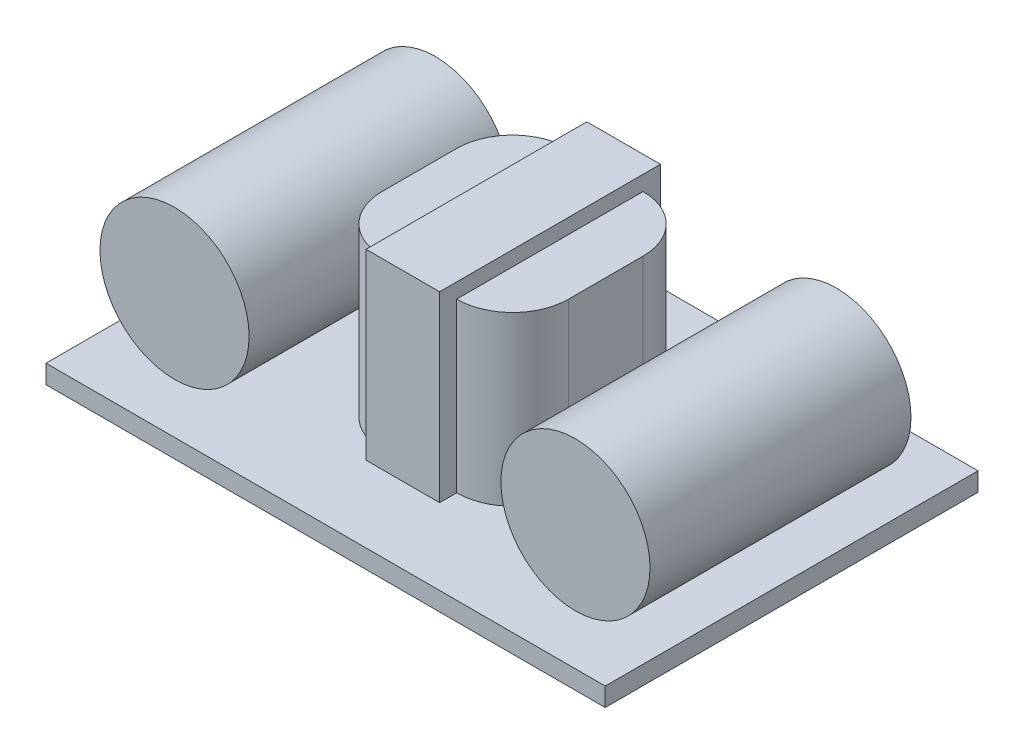
ISO-10303-21;
HEADER;
FILE_DESCRIPTION(('STEP AP214'),'2;1');
FILE_NAME('part.step','',(''),(''),'','','');
FILE_SCHEMA(('AUTOMOTIVE_DESIGN { 1 0 10303 214 1 1 1 1 }'));
ENDSEC;
DATA;
#1=APPLICATION_CONTEXT('core data for automotive mechanical design processes');
#2=APPLICATION_PROTOCOL_DEFINITION('international standard','automotive_design',2000,#1);
#3=PRODUCT_CONTEXT('',#1,'mechanical');
#4=PRODUCT('Part','Part','',(#3));
#5=PRODUCT_RELATED_PRODUCT_CATEGORY('part','',(#4));
#6=PRODUCT_DEFINITION_FORMATION('','',#4);
#7=PRODUCT_DEFINITION_CONTEXT('part definition',#1,'design');
#8=PRODUCT_DEFINITION('design','',#6,#7);
#9=PRODUCT_DEFINITION_SHAPE('','',#8);
#10=(LENGTH_UNIT() NAMED_UNIT(*) SI_UNIT(.MILLI.,.METRE.));
#11=(NAMED_UNIT(*) PLANE_ANGLE_UNIT() SI_UNIT($,.RADIAN.));
#12=(NAMED_UNIT(*) SI_UNIT($,.STERADIAN.) SOLID_ANGLE_UNIT());
#13=UNCERTAINTY_MEASURE_WITH_UNIT(LENGTH_MEASURE(1.E-05),#10,'distance_accuracy_value','');
#14=(GEOMETRIC_REPRESENTATION_CONTEXT(3) GLOBAL_UNCERTAINTY_ASSIGNED_CONTEXT((#13)) GLOBAL_UNIT_ASSIGNED_CONTEXT((#10,
#11,#12)) REPRESENTATION_CONTEXT('',''));
#15=CARTESIAN_POINT('',(0.,0.,0.));
#16=DIRECTION('',(0.,0.,1.));
#17=DIRECTION('',(1.,0.,0.));
#18=AXIS2_PLACEMENT_3D('',#15,#16,#17);
#19=CARTESIAN_POINT('',(12.7389872475368,5.12016710144614,7.));
#20=DIRECTION('',(0.,0.,-1.));
#21=DIRECTION('',(-1.,0.,0.));
#22=AXIS2_PLACEMENT_3D('',#19,#20,#21);
#23=CYLINDRICAL_SURFACE('',#22,4.);
#24=CARTESIAN_POINT('',(12.7389872475368,5.12016710144614,7.));
#25=DIRECTION('',(0.,0.,1.));
#26=DIRECTION('',(1.,0.,0.));
#27=AXIS2_PLACEMENT_3D('',#24,#25,#26);
#28=CIRCLE('',#27,4.);
#29=CARTESIAN_POINT('',(16.7389872475368,5.12016710144614,7.));
#30=VERTEX_POINT('',#29);
#31=EDGE_CURVE('E11',#30,#30,#28,.T.);
#32=ORIENTED_EDGE('',*,*,#31,.F.);
#33=EDGE_LOOP('',(#32));
#34=FACE_BOUND('',#33,.T.);
#35=CARTESIAN_POINT('',(12.7389872475368,5.12016710144614,-7.));
#36=DIRECTION('',(0.,0.,1.));
#37=DIRECTION('',(1.,0.,0.));
#38=AXIS2_PLACEMENT_3D('',#35,#36,#37);
#39=CIRCLE('',#38,4.);
#40=CARTESIAN_POINT('',(16.7389872475368,5.12016710144614,-7.));
#41=VERTEX_POINT('',#40);
#42=EDGE_CURVE('E44',#41,#41,#39,.T.);
#43=ORIENTED_EDGE('',*,*,#42,.T.);
#44=EDGE_LOOP('',(#43));
#45=FACE_BOUND('',#44,.T.);
#46=ADVANCED_FACE('F41',(#34,#45),#23,.T.);
#47=CARTESIAN_POINT('',(12.7389872475368,5.12016710144614,7.));
#48=DIRECTION('',(0.,0.,1.));
#49=DIRECTION('',(1.,0.,0.));
#50=AXIS2_PLACEMENT_3D('',#47,#48,#49);
#51=PLANE('',#50);
#52=ORIENTED_EDGE('',*,*,#31,.T.);
#53=EDGE_LOOP('',(#52));
#54=FACE_BOUND('',#53,.T.);
#55=ADVANCED_FACE('F56',(#54),#51,.T.);
#56=CARTESIAN_POINT('',(12.7389872475368,5.12016710144614,-7.));
#57=DIRECTION('',(0.,0.,1.));
#58=DIRECTION('',(1.,0.,0.));
#59=AXIS2_PLACEMENT_3D('',#56,#57,#58);
#60=PLANE('',#59);
#61=ORIENTED_EDGE('',*,*,#42,.F.);
#62=EDGE_LOOP('',(#61));
#63=FACE_BOUND('',#62,.T.);
#64=ADVANCED_FACE('F54',(#63),#60,.F.);
#65=CLOSED_SHELL('',(#46,#55,#64));
#66=MANIFOLD_SOLID_BREP('B2',#65);
#67=CARTESIAN_POINT('',(-8.77028567959707,5.12016710144614,7.));
#68=DIRECTION('',(0.,0.,-1.));
#69=DIRECTION('',(-1.,0.,0.));
#70=AXIS2_PLACEMENT_3D('',#67,#68,#69);
#71=CYLINDRICAL_SURFACE('',#70,4.);
#72=CARTESIAN_POINT('',(-8.77028567959707,5.12016710144614,7.));
#73=DIRECTION('',(0.,0.,1.));
#74=DIRECTION('',(1.,0.,0.));
#75=AXIS2_PLACEMENT_3D('',#72,#73,#74);
#76=CIRCLE('',#75,4.);
#77=CARTESIAN_POINT('',(-4.77028567959707,5.12016710144614,7.));
#78=VERTEX_POINT('',#77);
#79=EDGE_CURVE('E40',#78,#78,#76,.T.);
#80=ORIENTED_EDGE('',*,*,#79,.F.);
#81=EDGE_LOOP('',(#80));
#82=FACE_BOUND('',#81,.T.);
#83=CARTESIAN_POINT('',(-8.77028567959707,5.12016710144614,-7.));
#84=DIRECTION('',(0.,0.,1.));
#85=DIRECTION('',(1.,0.,0.));
#86=AXIS2_PLACEMENT_3D('',#83,#84,#85);
#87=CIRCLE('',#86,4.);
#88=CARTESIAN_POINT('',(-4.77028567959707,5.12016710144614,-7.));
#89=VERTEX_POINT('',#88);
#90=EDGE_CURVE('E100',#89,#89,#87,.T.);
#91=ORIENTED_EDGE('',*,*,#90,.T.);
#92=EDGE_LOOP('',(#91));
#93=FACE_BOUND('',#92,.T.);
#94=ADVANCED_FACE('F97',(#82,#93),#71,.T.);
#95=CARTESIAN_POINT('',(-8.77028567959707,5.12016710144614,7.));
#96=DIRECTION('',(0.,0.,1.));
#97=DIRECTION('',(1.,0.,0.));
#98=AXIS2_PLACEMENT_3D('',#95,#96,#97);
#99=PLANE('',#98);
#100=ORIENTED_EDGE('',*,*,#79,.T.);
#101=EDGE_LOOP('',(#100));
#102=FACE_BOUND('',#101,.T.);
#103=ADVANCED_FACE('F112',(#102),#99,.T.);
#104=CARTESIAN_POINT('',(-8.77028567959707,5.12016710144614,-7.));
#105=DIRECTION('',(0.,0.,1.));
#106=DIRECTION('',(1.,0.,0.));
#107=AXIS2_PLACEMENT_3D('',#104,#105,#106);
#108=PLANE('',#107);
#109=ORIENTED_EDGE('',*,*,#90,.F.);
#110=EDGE_LOOP('',(#109));
#111=FACE_BOUND('',#110,.T.);
#112=ADVANCED_FACE('F110',(#111),#108,.F.);
#113=CLOSED_SHELL('',(#94,#103,#112));
#114=MANIFOLD_SOLID_BREP('B6',#113);
#115=CARTESIAN_POINT('',(0.,10.,0.));
#116=DIRECTION('',(0.,1.,0.));
#117=DIRECTION('',(0.,0.,1.));
#118=AXIS2_PLACEMENT_3D('',#115,#116,#117);
#119=PLANE('',#118);
#120=CARTESIAN_POINT('',(3.94697795764397,10.,-2.41888949530825));
#121=DIRECTION('',(0.,1.,0.));
#122=DIRECTION('',(0.,0.,1.));
#123=AXIS2_PLACEMENT_3D('',#120,#121,#122);
#124=CIRCLE('',#123,3.);
#125=CARTESIAN_POINT('',(6.94697795764397,10.,-2.41888949530825));
#126=VERTEX_POINT('',#125);
#127=CARTESIAN_POINT('',(3.94697795764397,10.,-5.41888949530825));
#128=VERTEX_POINT('',#127);
#129=EDGE_CURVE('E377',#126,#128,#124,.T.);
#130=ORIENTED_EDGE('',*,*,#129,.T.);
#131=DIRECTION('',(0.,0.,1.));
#132=VECTOR('',#131,1.);
#133=CARTESIAN_POINT('',(3.94697795764397,10.,0.));
#134=LINE('',#133,#132);
#135=CARTESIAN_POINT('',(3.94697795764397,10.,4.58111050469175));
#136=VERTEX_POINT('',#135);
#137=EDGE_CURVE('E301',#128,#136,#134,.T.);
#138=ORIENTED_EDGE('',*,*,#137,.T.);
#139=CARTESIAN_POINT('',(3.94697795764397,10.,1.58111050469175));
#140=DIRECTION('',(0.,1.,0.));
#141=DIRECTION('',(0.,0.,1.));
#142=AXIS2_PLACEMENT_3D('',#139,#140,#141);
#143=CIRCLE('',#142,3.);
#144=CARTESIAN_POINT('',(6.94697795764397,10.,1.58111050469175));
#145=VERTEX_POINT('',#144);
#146=EDGE_CURVE('E371',#136,#145,#143,.T.);
#147=ORIENTED_EDGE('',*,*,#146,.T.);
#148=DIRECTION('',(0.,0.,-1.));
#149=VECTOR('',#148,1.);
#150=CARTESIAN_POINT('',(6.94697795764397,10.,-5.41888949530825));
#151=LINE('',#150,#149);
#152=EDGE_CURVE('E315',#145,#126,#151,.T.);
#153=ORIENTED_EDGE('',*,*,#152,.T.);
#154=EDGE_LOOP('',(#130,#138,#147,#153));
#155=FACE_BOUND('',#154,.T.);
#156=ADVANCED_FACE('F144',(#155),#119,.T.);
#157=CARTESIAN_POINT('',(0.,1.,0.));
#158=DIRECTION('',(0.,1.,0.));
#159=DIRECTION('',(0.,0.,1.));
#160=AXIS2_PLACEMENT_3D('',#157,#158,#159);
#161=PLANE('',#160);
#162=DIRECTION('',(0.,0.,-1.));
#163=VECTOR('',#162,1.);
#164=CARTESIAN_POINT('',(0.,1.,5.49541829506448));
#165=LINE('',#164,#163);
#166=CARTESIAN_POINT('',(0.,1.,-5.41888949530825));
#167=VERTEX_POINT('',#166);
#168=CARTESIAN_POINT('',(0.,1.,-6.35116401633587));
#169=VERTEX_POINT('',#168);
#170=EDGE_CURVE('E159',#167,#169,#165,.T.);
#171=ORIENTED_EDGE('',*,*,#170,.T.);
#172=DIRECTION('',(-1.,0.,0.));
#173=VECTOR('',#172,1.);
#174=CARTESIAN_POINT('',(22.3214742291087,1.,-6.35116401633587));
#175=LINE('',#174,#173);
#176=CARTESIAN_POINT('',(3.94697795764397,1.,-6.35116401633587));
#177=VERTEX_POINT('',#176);
#178=EDGE_CURVE('E163',#177,#169,#175,.T.);
#179=ORIENTED_EDGE('',*,*,#178,.F.);
#180=DIRECTION('',(0.,0.,1.));
#181=VECTOR('',#180,1.);
#182=CARTESIAN_POINT('',(3.94697795764396,1.,5.49541829506448));
#183=LINE('',#182,#181);
#184=CARTESIAN_POINT('',(3.94697795764397,1.,-5.41888949530825));
#185=VERTEX_POINT('',#184);
#186=EDGE_CURVE('E409',#177,#185,#183,.T.);
#187=ORIENTED_EDGE('',*,*,#186,.T.);
#188=CARTESIAN_POINT('',(3.94697795764397,0.999999999999999,-2.41888949530825));
#189=DIRECTION('',(0.,1.,0.));
#190=DIRECTION('',(0.,0.,1.));
#191=AXIS2_PLACEMENT_3D('',#188,#189,#190);
#192=CIRCLE('',#191,3.);
#193=CARTESIAN_POINT('',(6.94697795764397,1.,-2.41888949530825));
#194=VERTEX_POINT('',#193);
#195=EDGE_CURVE('E390',#185,#194,#192,.F.);
#196=ORIENTED_EDGE('',*,*,#195,.T.);
#197=DIRECTION('',(0.,0.,1.));
#198=VECTOR('',#197,1.);
#199=CARTESIAN_POINT('',(6.94697795764397,1.,0.));
#200=LINE('',#199,#198);
#201=CARTESIAN_POINT('',(6.94697795764397,1.,1.58111050469175));
#202=VERTEX_POINT('',#201);
#203=EDGE_CURVE('E322',#194,#202,#200,.T.);
#204=ORIENTED_EDGE('',*,*,#203,.T.);
#205=CARTESIAN_POINT('',(3.94697795764397,0.999999999999999,1.58111050469175));
#206=DIRECTION('',(0.,1.,0.));
#207=DIRECTION('',(0.,0.,1.));
#208=AXIS2_PLACEMENT_3D('',#205,#206,#207);
#209=CIRCLE('',#208,3.);
#210=CARTESIAN_POINT('',(3.94697795764397,1.,4.58111050469175));
#211=VERTEX_POINT('',#210);
#212=EDGE_CURVE('E152',#202,#211,#209,.F.);
#213=ORIENTED_EDGE('',*,*,#212,.T.);
#214=CARTESIAN_POINT('',(3.94697795764396,1.,5.49541829506448));
#215=VERTEX_POINT('',#214);
#216=EDGE_CURVE('E399',#211,#215,#183,.T.);
#217=ORIENTED_EDGE('',*,*,#216,.T.);
#218=DIRECTION('',(-1.,0.,0.));
#219=VECTOR('',#218,1.);
#220=CARTESIAN_POINT('',(22.3214742291087,1.,5.49541829506448));
#221=LINE('',#220,#219);
#222=CARTESIAN_POINT('',(0.,1.,5.49541829506448));
#223=VERTEX_POINT('',#222);
#224=EDGE_CURVE('E297',#215,#223,#221,.T.);
#225=ORIENTED_EDGE('',*,*,#224,.T.);
#226=CARTESIAN_POINT('',(0.,1.,4.58111050469175));
#227=VERTEX_POINT('',#226);
#228=EDGE_CURVE('E285',#223,#227,#165,.T.);
#229=ORIENTED_EDGE('',*,*,#228,.T.);
#230=DIRECTION('',(-1.,0.,0.));
#231=VECTOR('',#230,1.);
#232=CARTESIAN_POINT('',(0.,1.,4.58111050469175));
#233=LINE('',#232,#231);
#234=CARTESIAN_POINT('',(-0.053022042356033,1.,4.58111050469175));
#235=VERTEX_POINT('',#234);
#236=EDGE_CURVE('E325',#227,#235,#233,.T.);
#237=ORIENTED_EDGE('',*,*,#236,.T.);
#238=CARTESIAN_POINT('',(-0.053022042356033,0.999999999999999,1.58111050469175));
#239=DIRECTION('',(0.,1.,0.));
#240=DIRECTION('',(0.,0.,1.));
#241=AXIS2_PLACEMENT_3D('',#238,#239,#240);
#242=CIRCLE('',#241,3.);
#243=CARTESIAN_POINT('',(-3.05302204235603,1.,1.58111050469175));
#244=VERTEX_POINT('',#243);
#245=EDGE_CURVE('E394',#235,#244,#242,.F.);
#246=ORIENTED_EDGE('',*,*,#245,.T.);
#247=DIRECTION('',(0.,0.,-1.));
#248=VECTOR('',#247,1.);
#249=CARTESIAN_POINT('',(-3.05302204235603,1.,0.));
#250=LINE('',#249,#248);
#251=CARTESIAN_POINT('',(-3.05302204235603,1.,-2.41888949530825));
#252=VERTEX_POINT('',#251);
#253=EDGE_CURVE('E327',#244,#252,#250,.T.);
#254=ORIENTED_EDGE('',*,*,#253,.T.);
#255=CARTESIAN_POINT('',(-0.0530220423560333,0.999999999999999,-2.41888949530825));
#256=DIRECTION('',(0.,1.,0.));
#257=DIRECTION('',(0.,0.,1.));
#258=AXIS2_PLACEMENT_3D('',#255,#256,#257);
#259=CIRCLE('',#258,3.);
#260=CARTESIAN_POINT('',(-0.0530220423560333,1.,-5.41888949530825));
#261=VERTEX_POINT('',#260);
#262=EDGE_CURVE('E392',#252,#261,#259,.F.);
#263=ORIENTED_EDGE('',*,*,#262,.T.);
#264=DIRECTION('',(1.,0.,0.));
#265=VECTOR('',#264,1.);
#266=CARTESIAN_POINT('',(0.,1.,-5.41888949530825));
#267=LINE('',#266,#265);
#268=EDGE_CURVE('E320',#261,#167,#267,.T.);
#269=ORIENTED_EDGE('',*,*,#268,.T.);
#270=EDGE_LOOP('',(#171,#179,#187,#196,#204,#213,#217,#225,#229,#237,#246,#254,#263,#269));
#271=FACE_BOUND('',#270,.T.);
#272=DIRECTION('',(0.,0.,1.));
#273=VECTOR('',#272,1.);
#274=CARTESIAN_POINT('',(-13.0929095354523,1.,-10.4278728606357));
#275=LINE('',#274,#273);
#276=CARTESIAN_POINT('',(-13.0929095354523,1.,-10.4278728606357));
#277=VERTEX_POINT('',#276);
#278=CARTESIAN_POINT('',(-13.0929095354523,1.,9.5721271393643));
#279=VERTEX_POINT('',#278);
#280=EDGE_CURVE('E331',#277,#279,#275,.T.);
#281=ORIENTED_EDGE('',*,*,#280,.T.);
#282=DIRECTION('',(1.,0.,0.));
#283=VECTOR('',#282,1.);
#284=CARTESIAN_POINT('',(-13.0929095354523,1.,9.5721271393643));
#285=LINE('',#284,#283);
#286=CARTESIAN_POINT('',(16.9070904645477,1.,9.5721271393643));
#287=VERTEX_POINT('',#286);
#288=EDGE_CURVE('E334',#279,#287,#285,.T.);
#289=ORIENTED_EDGE('',*,*,#288,.T.);
#290=DIRECTION('',(0.,0.,-1.));
#291=VECTOR('',#290,1.);
#292=CARTESIAN_POINT('',(16.9070904645477,1.,-10.4278728606357));
#293=LINE('',#292,#291);
#294=CARTESIAN_POINT('',(16.9070904645477,1.,-10.4278728606357));
#295=VERTEX_POINT('',#294);
#296=EDGE_CURVE('E337',#287,#295,#293,.T.);
#297=ORIENTED_EDGE('',*,*,#296,.T.);
#298=DIRECTION('',(-1.,0.,0.));
#299=VECTOR('',#298,1.);
#300=CARTESIAN_POINT('',(-13.0929095354523,1.,-10.4278728606357));
#301=LINE('',#300,#299);
#302=EDGE_CURVE('E339',#295,#277,#301,.T.);
#303=ORIENTED_EDGE('',*,*,#302,.T.);
#304=EDGE_LOOP('',(#281,#289,#297,#303));
#305=FACE_BOUND('',#304,.T.);
#306=ADVANCED_FACE('F396',(#271,#305),#161,.T.);
#307=CARTESIAN_POINT('',(-13.0929095354523,1.,-10.4278728606357));
#308=DIRECTION('',(1.,0.,0.));
#309=DIRECTION('',(0.,0.,-1.));
#310=AXIS2_PLACEMENT_3D('',#307,#308,#309);
#311=PLANE('',#310);
#312=DIRECTION('',(0.,0.,1.));
#313=VECTOR('',#312,1.);
#314=CARTESIAN_POINT('',(-13.0929095354523,0.,-10.4278728606357));
#315=LINE('',#314,#313);
#316=CARTESIAN_POINT('',(-13.0929095354523,0.,-10.4278728606357));
#317=VERTEX_POINT('',#316);
#318=CARTESIAN_POINT('',(-13.0929095354523,0.,9.5721271393643));
#319=VERTEX_POINT('',#318);
#320=EDGE_CURVE('E330',#317,#319,#315,.T.);
#321=ORIENTED_EDGE('',*,*,#320,.T.);
#322=DIRECTION('',(0.,-1.,0.));
#323=VECTOR('',#322,1.);
#324=CARTESIAN_POINT('',(-13.0929095354523,1.,9.5721271393643));
#325=LINE('',#324,#323);
#326=EDGE_CURVE('E357',#279,#319,#325,.T.);
#327=ORIENTED_EDGE('',*,*,#326,.F.);
#328=ORIENTED_EDGE('',*,*,#280,.F.);
#329=DIRECTION('',(0.,-1.,0.));
#330=VECTOR('',#329,1.);
#331=CARTESIAN_POINT('',(-13.0929095354523,1.,-10.4278728606357));
#332=LINE('',#331,#330);
#333=EDGE_CURVE('E341',#277,#317,#332,.T.);
#334=ORIENTED_EDGE('',*,*,#333,.T.);
#335=EDGE_LOOP('',(#321,#327,#328,#334));
#336=FACE_BOUND('',#335,.T.);
#337=ADVANCED_FACE('F453',(#336),#311,.F.);
#338=CARTESIAN_POINT('',(-13.0929095354523,1.,9.5721271393643));
#339=DIRECTION('',(0.,0.,-1.));
#340=DIRECTION('',(-1.,0.,0.));
#341=AXIS2_PLACEMENT_3D('',#338,#339,#340);
#342=PLANE('',#341);
#343=DIRECTION('',(1.,0.,0.));
#344=VECTOR('',#343,1.);
#345=CARTESIAN_POINT('',(-13.0929095354523,0.,9.5721271393643));
#346=LINE('',#345,#344);
#347=CARTESIAN_POINT('',(16.9070904645477,0.,9.5721271393643));
#348=VERTEX_POINT('',#347);
#349=EDGE_CURVE('E344',#319,#348,#346,.T.);
#350=ORIENTED_EDGE('',*,*,#349,.T.);
#351=DIRECTION('',(0.,-1.,0.));
#352=VECTOR('',#351,1.);
#353=CARTESIAN_POINT('',(16.9070904645477,1.,9.5721271393643));
#354=LINE('',#353,#352);
#355=EDGE_CURVE('E354',#287,#348,#354,.T.);
#356=ORIENTED_EDGE('',*,*,#355,.F.);
#357=ORIENTED_EDGE('',*,*,#288,.F.);
#358=ORIENTED_EDGE('',*,*,#326,.T.);
#359=EDGE_LOOP('',(#350,#356,#357,#358));
#360=FACE_BOUND('',#359,.T.);
#361=ADVANCED_FACE('F486',(#360),#342,.F.);
#362=CARTESIAN_POINT('',(16.9070904645477,1.,-10.4278728606357));
#363=DIRECTION('',(-1.,0.,0.));
#364=DIRECTION('',(0.,0.,1.));
#365=AXIS2_PLACEMENT_3D('',#362,#363,#364);
#366=PLANE('',#365);
#367=DIRECTION('',(0.,0.,-1.));
#368=VECTOR('',#367,1.);
#369=CARTESIAN_POINT('',(16.9070904645477,0.,-10.4278728606357));
#370=LINE('',#369,#368);
#371=CARTESIAN_POINT('',(16.9070904645477,0.,-10.4278728606357));
#372=VERTEX_POINT('',#371);
#373=EDGE_CURVE('E346',#348,#372,#370,.T.);
#374=ORIENTED_EDGE('',*,*,#373,.T.);
#375=DIRECTION('',(0.,-1.,0.));
#376=VECTOR('',#375,1.);
#377=CARTESIAN_POINT('',(16.9070904645477,1.,-10.4278728606357));
#378=LINE('',#377,#376);
#379=EDGE_CURVE('E351',#295,#372,#378,.T.);
#380=ORIENTED_EDGE('',*,*,#379,.F.);
#381=ORIENTED_EDGE('',*,*,#296,.F.);
#382=ORIENTED_EDGE('',*,*,#355,.T.);
#383=EDGE_LOOP('',(#374,#380,#381,#382));
#384=FACE_BOUND('',#383,.T.);
#385=ADVANCED_FACE('F482',(#384),#366,.F.);
#386=CARTESIAN_POINT('',(-13.0929095354523,1.,-10.4278728606357));
#387=DIRECTION('',(0.,0.,1.));
#388=DIRECTION('',(1.,0.,0.));
#389=AXIS2_PLACEMENT_3D('',#386,#387,#388);
#390=PLANE('',#389);
#391=DIRECTION('',(-1.,0.,0.));
#392=VECTOR('',#391,1.);
#393=CARTESIAN_POINT('',(-13.0929095354523,0.,-10.4278728606357));
#394=LINE('',#393,#392);
#395=EDGE_CURVE('E335',#372,#317,#394,.T.);
#396=ORIENTED_EDGE('',*,*,#395,.T.);
#397=ORIENTED_EDGE('',*,*,#333,.F.);
#398=ORIENTED_EDGE('',*,*,#302,.F.);
#399=ORIENTED_EDGE('',*,*,#379,.T.);
#400=EDGE_LOOP('',(#396,#397,#398,#399));
#401=FACE_BOUND('',#400,.T.);
#402=ADVANCED_FACE('F478',(#401),#390,.F.);
#403=CARTESIAN_POINT('',(0.,0.,0.));
#404=DIRECTION('',(0.,1.,0.));
#405=DIRECTION('',(0.,0.,1.));
#406=AXIS2_PLACEMENT_3D('',#403,#404,#405);
#407=PLANE('',#406);
#408=ORIENTED_EDGE('',*,*,#320,.F.);
#409=ORIENTED_EDGE('',*,*,#395,.F.);
#410=ORIENTED_EDGE('',*,*,#373,.F.);
#411=ORIENTED_EDGE('',*,*,#349,.F.);
#412=EDGE_LOOP('',(#408,#409,#410,#411));
#413=FACE_BOUND('',#412,.T.);
#414=ADVANCED_FACE('F474',(#413),#407,.F.);
#415=CARTESIAN_POINT('',(-3.05302204235603,10.,-5.41888949530825));
#416=DIRECTION('',(1.,0.,0.));
#417=DIRECTION('',(0.,0.,-1.));
#418=AXIS2_PLACEMENT_3D('',#415,#416,#417);
#419=PLANE('',#418);
#420=DIRECTION('',(0.,0.,1.));
#421=VECTOR('',#420,1.);
#422=CARTESIAN_POINT('',(-3.05302204235603,10.,-5.41888949530825));
#423=LINE('',#422,#421);
#424=CARTESIAN_POINT('',(-3.05302204235603,10.,-2.41888949530825));
#425=VERTEX_POINT('',#424);
#426=CARTESIAN_POINT('',(-3.05302204235603,10.,1.58111050469175));
#427=VERTEX_POINT('',#426);
#428=EDGE_CURVE('E309',#425,#427,#423,.T.);
#429=ORIENTED_EDGE('',*,*,#428,.F.);
#430=DIRECTION('',(0.,-1.,0.));
#431=VECTOR('',#430,1.);
#432=CARTESIAN_POINT('',(-3.05302204235603,10.,-2.41888949530825));
#433=LINE('',#432,#431);
#434=EDGE_CURVE('E381',#425,#252,#433,.T.);
#435=ORIENTED_EDGE('',*,*,#434,.T.);
#436=ORIENTED_EDGE('',*,*,#253,.F.);
#437=DIRECTION('',(0.,-1.,0.));
#438=VECTOR('',#437,1.);
#439=CARTESIAN_POINT('',(-3.05302204235603,10.,1.58111050469175));
#440=LINE('',#439,#438);
#441=EDGE_CURVE('E379',#244,#427,#440,.F.);
#442=ORIENTED_EDGE('',*,*,#441,.T.);
#443=EDGE_LOOP('',(#429,#435,#436,#442));
#444=FACE_BOUND('',#443,.T.);
#445=ADVANCED_FACE('F435',(#444),#419,.F.);
#446=CARTESIAN_POINT('',(-3.05302204235603,10.,4.58111050469175));
#447=DIRECTION('',(0.,0.,-1.));
#448=DIRECTION('',(-1.,0.,0.));
#449=AXIS2_PLACEMENT_3D('',#446,#447,#448);
#450=PLANE('',#449);
#451=ORIENTED_EDGE('',*,*,#236,.F.);
#452=DIRECTION('',(0.,1.,0.));
#453=VECTOR('',#452,1.);
#454=CARTESIAN_POINT('',(0.,10.,4.58111050469175));
#455=LINE('',#454,#453);
#456=CARTESIAN_POINT('',(0.,10.,4.58111050469175));
#457=VERTEX_POINT('',#456);
#458=EDGE_CURVE('E307',#227,#457,#455,.T.);
#459=ORIENTED_EDGE('',*,*,#458,.T.);
#460=DIRECTION('',(1.,0.,0.));
#461=VECTOR('',#460,1.);
#462=CARTESIAN_POINT('',(-3.05302204235603,10.,4.58111050469175));
#463=LINE('',#462,#461);
#464=CARTESIAN_POINT('',(-0.053022042356033,10.,4.58111050469175));
#465=VERTEX_POINT('',#464);
#466=EDGE_CURVE('E312',#465,#457,#463,.T.);
#467=ORIENTED_EDGE('',*,*,#466,.F.);
#468=DIRECTION('',(0.,-1.,0.));
#469=VECTOR('',#468,1.);
#470=CARTESIAN_POINT('',(-0.053022042356033,10.,4.58111050469175));
#471=LINE('',#470,#469);
#472=EDGE_CURVE('E387',#465,#235,#471,.T.);
#473=ORIENTED_EDGE('',*,*,#472,.T.);
#474=EDGE_LOOP('',(#451,#459,#467,#473));
#475=FACE_BOUND('',#474,.T.);
#476=ADVANCED_FACE('F417',(#475),#450,.F.);
#477=CARTESIAN_POINT('',(6.94697795764397,10.,-5.41888949530825));
#478=DIRECTION('',(-1.,0.,0.));
#479=DIRECTION('',(0.,0.,1.));
#480=AXIS2_PLACEMENT_3D('',#477,#478,#479);
#481=PLANE('',#480);
#482=ORIENTED_EDGE('',*,*,#203,.F.);
#483=DIRECTION('',(0.,-1.,0.));
#484=VECTOR('',#483,1.);
#485=CARTESIAN_POINT('',(6.94697795764397,10.,-2.41888949530825));
#486=LINE('',#485,#484);
#487=EDGE_CURVE('E369',#194,#126,#486,.F.);
#488=ORIENTED_EDGE('',*,*,#487,.T.);
#489=ORIENTED_EDGE('',*,*,#152,.F.);
#490=DIRECTION('',(0.,-1.,0.));
#491=VECTOR('',#490,1.);
#492=CARTESIAN_POINT('',(6.94697795764397,10.,1.58111050469175));
#493=LINE('',#492,#491);
#494=EDGE_CURVE('E366',#145,#202,#493,.T.);
#495=ORIENTED_EDGE('',*,*,#494,.T.);
#496=EDGE_LOOP('',(#482,#488,#489,#495));
#497=FACE_BOUND('',#496,.T.);
#498=ADVANCED_FACE('F464',(#497),#481,.F.);
#499=CARTESIAN_POINT('',(-3.05302204235603,10.,-5.41888949530825));
#500=DIRECTION('',(0.,0.,1.));
#501=DIRECTION('',(1.,0.,0.));
#502=AXIS2_PLACEMENT_3D('',#499,#500,#501);
#503=PLANE('',#502);
#504=DIRECTION('',(-1.,0.,0.));
#505=VECTOR('',#504,1.);
#506=CARTESIAN_POINT('',(-3.05302204235603,10.,-5.41888949530825));
#507=LINE('',#506,#505);
#508=CARTESIAN_POINT('',(0.,10.,-5.41888949530825));
#509=VERTEX_POINT('',#508);
#510=CARTESIAN_POINT('',(-0.0530220423560334,10.,-5.41888949530825));
#511=VERTEX_POINT('',#510);
#512=EDGE_CURVE('E318',#509,#511,#507,.T.);
#513=ORIENTED_EDGE('',*,*,#512,.F.);
#514=DIRECTION('',(0.,-1.,0.));
#515=VECTOR('',#514,1.);
#516=CARTESIAN_POINT('',(0.,10.,-5.41888949530825));
#517=LINE('',#516,#515);
#518=EDGE_CURVE('E304',#509,#167,#517,.T.);
#519=ORIENTED_EDGE('',*,*,#518,.T.);
#520=ORIENTED_EDGE('',*,*,#268,.F.);
#521=DIRECTION('',(0.,-1.,0.));
#522=VECTOR('',#521,1.);
#523=CARTESIAN_POINT('',(-0.0530220423560334,10.,-5.41888949530825));
#524=LINE('',#523,#522);
#525=EDGE_CURVE('E360',#261,#511,#524,.F.);
#526=ORIENTED_EDGE('',*,*,#525,.T.);
#527=EDGE_LOOP('',(#513,#519,#520,#526));
#528=FACE_BOUND('',#527,.T.);
#529=ADVANCED_FACE('F425',(#528),#503,.F.);
#530=DIRECTION('',(0.,0.,1.));
#531=VECTOR('',#530,1.);
#532=CARTESIAN_POINT('',(0.,10.,0.));
#533=LINE('',#532,#531);
#534=EDGE_CURVE('E95',#509,#457,#533,.T.);
#535=ORIENTED_EDGE('',*,*,#534,.F.);
#536=ORIENTED_EDGE('',*,*,#512,.T.);
#537=CARTESIAN_POINT('',(-0.0530220423560333,10.,-2.41888949530825));
#538=DIRECTION('',(0.,1.,0.));
#539=DIRECTION('',(0.,0.,1.));
#540=AXIS2_PLACEMENT_3D('',#537,#538,#539);
#541=CIRCLE('',#540,3.);
#542=EDGE_CURVE('E375',#511,#425,#541,.T.);
#543=ORIENTED_EDGE('',*,*,#542,.T.);
#544=ORIENTED_EDGE('',*,*,#428,.T.);
#545=CARTESIAN_POINT('',(-0.053022042356033,10.,1.58111050469175));
#546=DIRECTION('',(0.,1.,0.));
#547=DIRECTION('',(0.,0.,1.));
#548=AXIS2_PLACEMENT_3D('',#545,#546,#547);
#549=CIRCLE('',#548,3.);
#550=EDGE_CURVE('E373',#427,#465,#549,.T.);
#551=ORIENTED_EDGE('',*,*,#550,.T.);
#552=ORIENTED_EDGE('',*,*,#466,.T.);
#553=EDGE_LOOP('',(#535,#536,#543,#544,#551,#552));
#554=FACE_BOUND('',#553,.T.);
#555=ADVANCED_FACE('F423',(#554),#119,.T.);
#556=CARTESIAN_POINT('',(3.94697795764397,10.,-2.41888949530825));
#557=DIRECTION('',(0.,-1.,0.));
#558=DIRECTION('',(0.,0.,-1.));
#559=AXIS2_PLACEMENT_3D('',#556,#557,#558);
#560=CYLINDRICAL_SURFACE('',#559,3.);
#561=ORIENTED_EDGE('',*,*,#129,.F.);
#562=ORIENTED_EDGE('',*,*,#487,.F.);
#563=ORIENTED_EDGE('',*,*,#195,.F.);
#564=DIRECTION('',(0.,-1.,0.));
#565=VECTOR('',#564,1.);
#566=CARTESIAN_POINT('',(3.94697795764397,10.,-5.41888949530825));
#567=LINE('',#566,#565);
#568=EDGE_CURVE('E363',#128,#185,#567,.T.);
#569=ORIENTED_EDGE('',*,*,#568,.F.);
#570=EDGE_LOOP('',(#561,#562,#563,#569));
#571=FACE_BOUND('',#570,.T.);
#572=ADVANCED_FACE('F445',(#571),#560,.T.);
#573=CARTESIAN_POINT('',(-0.0530220423560333,10.,-2.41888949530825));
#574=DIRECTION('',(0.,-1.,0.));
#575=DIRECTION('',(0.,0.,-1.));
#576=AXIS2_PLACEMENT_3D('',#573,#574,#575);
#577=CYLINDRICAL_SURFACE('',#576,3.);
#578=ORIENTED_EDGE('',*,*,#542,.F.);
#579=ORIENTED_EDGE('',*,*,#525,.F.);
#580=ORIENTED_EDGE('',*,*,#262,.F.);
#581=ORIENTED_EDGE('',*,*,#434,.F.);
#582=EDGE_LOOP('',(#578,#579,#580,#581));
#583=FACE_BOUND('',#582,.T.);
#584=ADVANCED_FACE('F431',(#583),#577,.T.);
#585=CARTESIAN_POINT('',(-0.053022042356033,10.,1.58111050469175));
#586=DIRECTION('',(0.,-1.,0.));
#587=DIRECTION('',(0.,0.,-1.));
#588=AXIS2_PLACEMENT_3D('',#585,#586,#587);
#589=CYLINDRICAL_SURFACE('',#588,3.);
#590=ORIENTED_EDGE('',*,*,#550,.F.);
#591=ORIENTED_EDGE('',*,*,#441,.F.);
#592=ORIENTED_EDGE('',*,*,#245,.F.);
#593=ORIENTED_EDGE('',*,*,#472,.F.);
#594=EDGE_LOOP('',(#590,#591,#592,#593));
#595=FACE_BOUND('',#594,.T.);
#596=ADVANCED_FACE('F439',(#595),#589,.T.);
#597=CARTESIAN_POINT('',(3.94697795764397,10.,1.58111050469175));
#598=DIRECTION('',(0.,-1.,0.));
#599=DIRECTION('',(0.,0.,-1.));
#600=AXIS2_PLACEMENT_3D('',#597,#598,#599);
#601=CYLINDRICAL_SURFACE('',#600,3.);
#602=ORIENTED_EDGE('',*,*,#146,.F.);
#603=DIRECTION('',(0.,-1.,0.));
#604=VECTOR('',#603,1.);
#605=CARTESIAN_POINT('',(3.94697795764397,10.,4.58111050469175));
#606=LINE('',#605,#604);
#607=EDGE_CURVE('E384',#211,#136,#606,.F.);
#608=ORIENTED_EDGE('',*,*,#607,.F.);
#609=ORIENTED_EDGE('',*,*,#212,.F.);
#610=ORIENTED_EDGE('',*,*,#494,.F.);
#611=EDGE_LOOP('',(#602,#608,#609,#610));
#612=FACE_BOUND('',#611,.T.);
#613=ADVANCED_FACE('F146',(#612),#601,.T.);
#614=CARTESIAN_POINT('',(0.,0.,0.));
#615=DIRECTION('',(-1.,0.,0.));
#616=DIRECTION('',(0.,0.,1.));
#617=AXIS2_PLACEMENT_3D('',#614,#615,#616);
#618=PLANE('',#617);
#619=ORIENTED_EDGE('',*,*,#458,.F.);
#620=ORIENTED_EDGE('',*,*,#228,.F.);
#621=DIRECTION('',(0.,-1.,0.));
#622=VECTOR('',#621,1.);
#623=CARTESIAN_POINT('',(0.,1.,5.49541829506448));
#624=LINE('',#623,#622);
#625=CARTESIAN_POINT('',(0.,10.7996746446247,5.49541829506448));
#626=VERTEX_POINT('',#625);
#627=EDGE_CURVE('E291',#626,#223,#624,.T.);
#628=ORIENTED_EDGE('',*,*,#627,.F.);
#629=DIRECTION('',(0.,0.,1.));
#630=VECTOR('',#629,1.);
#631=CARTESIAN_POINT('',(0.,10.7996746446247,5.49541829506448));
#632=LINE('',#631,#630);
#633=CARTESIAN_POINT('',(0.,10.7996746446247,-6.35116401633587));
#634=VERTEX_POINT('',#633);
#635=EDGE_CURVE('E274',#634,#626,#632,.T.);
#636=ORIENTED_EDGE('',*,*,#635,.F.);
#637=DIRECTION('',(0.,1.,0.));
#638=VECTOR('',#637,1.);
#639=CARTESIAN_POINT('',(0.,1.,-6.35116401633587));
#640=LINE('',#639,#638);
#641=EDGE_CURVE('E282',#169,#634,#640,.T.);
#642=ORIENTED_EDGE('',*,*,#641,.F.);
#643=ORIENTED_EDGE('',*,*,#170,.F.);
#644=ORIENTED_EDGE('',*,*,#518,.F.);
#645=ORIENTED_EDGE('',*,*,#534,.T.);
#646=EDGE_LOOP('',(#619,#620,#628,#636,#642,#643,#644,#645));
#647=FACE_BOUND('',#646,.T.);
#648=ADVANCED_FACE('F288',(#647),#618,.T.);
#649=CARTESIAN_POINT('',(3.94697795764397,10.,-5.41888949530825));
#650=DIRECTION('',(-1.,0.,0.));
#651=DIRECTION('',(0.,0.,1.));
#652=AXIS2_PLACEMENT_3D('',#649,#650,#651);
#653=PLANE('',#652);
#654=ORIENTED_EDGE('',*,*,#137,.F.);
#655=ORIENTED_EDGE('',*,*,#568,.T.);
#656=ORIENTED_EDGE('',*,*,#186,.F.);
#657=DIRECTION('',(0.,-1.,0.));
#658=VECTOR('',#657,1.);
#659=CARTESIAN_POINT('',(3.94697795764396,1.,-6.35116401633587));
#660=LINE('',#659,#658);
#661=CARTESIAN_POINT('',(3.94697795764397,10.7996746446247,-6.35116401633587));
#662=VERTEX_POINT('',#661);
#663=EDGE_CURVE('E300',#662,#177,#660,.T.);
#664=ORIENTED_EDGE('',*,*,#663,.F.);
#665=DIRECTION('',(0.,0.,-1.));
#666=VECTOR('',#665,1.);
#667=CARTESIAN_POINT('',(3.94697795764396,10.7996746446247,5.49541829506448));
#668=LINE('',#667,#666);
#669=CARTESIAN_POINT('',(3.94697795764396,10.7996746446247,5.49541829506448));
#670=VERTEX_POINT('',#669);
#671=EDGE_CURVE('E276',#670,#662,#668,.T.);
#672=ORIENTED_EDGE('',*,*,#671,.F.);
#673=DIRECTION('',(0.,1.,0.));
#674=VECTOR('',#673,1.);
#675=CARTESIAN_POINT('',(3.94697795764396,1.,5.49541829506448));
#676=LINE('',#675,#674);
#677=EDGE_CURVE('E305',#215,#670,#676,.T.);
#678=ORIENTED_EDGE('',*,*,#677,.F.);
#679=ORIENTED_EDGE('',*,*,#216,.F.);
#680=ORIENTED_EDGE('',*,*,#607,.T.);
#681=EDGE_LOOP('',(#654,#655,#656,#664,#672,#678,#679,#680));
#682=FACE_BOUND('',#681,.T.);
#683=ADVANCED_FACE('F406',(#682),#653,.F.);
#684=CARTESIAN_POINT('',(22.3214742291087,10.7996746446247,5.49541829506448));
#685=DIRECTION('',(0.,-1.,0.));
#686=DIRECTION('',(0.,0.,-1.));
#687=AXIS2_PLACEMENT_3D('',#684,#685,#686);
#688=PLANE('',#687);
#689=DIRECTION('',(-1.,0.,0.));
#690=VECTOR('',#689,1.);
#691=CARTESIAN_POINT('',(22.3214742291087,10.7996746446247,5.49541829506448));
#692=LINE('',#691,#690);
#693=EDGE_CURVE('E279',#670,#626,#692,.T.);
#694=ORIENTED_EDGE('',*,*,#693,.F.);
#695=ORIENTED_EDGE('',*,*,#671,.T.);
#696=DIRECTION('',(-1.,0.,0.));
#697=VECTOR('',#696,1.);
#698=CARTESIAN_POINT('',(22.3214742291087,10.7996746446247,-6.35116401633587));
#699=LINE('',#698,#697);
#700=EDGE_CURVE('E269',#662,#634,#699,.T.);
#701=ORIENTED_EDGE('',*,*,#700,.T.);
#702=ORIENTED_EDGE('',*,*,#635,.T.);
#703=EDGE_LOOP('',(#694,#695,#701,#702));
#704=FACE_BOUND('',#703,.T.);
#705=ADVANCED_FACE('F272',(#704),#688,.F.);
#706=CARTESIAN_POINT('',(22.3214742291087,1.,-6.35116401633587));
#707=DIRECTION('',(0.,0.,1.));
#708=DIRECTION('',(1.,0.,0.));
#709=AXIS2_PLACEMENT_3D('',#706,#707,#708);
#710=PLANE('',#709);
#711=ORIENTED_EDGE('',*,*,#700,.F.);
#712=ORIENTED_EDGE('',*,*,#663,.T.);
#713=ORIENTED_EDGE('',*,*,#178,.T.);
#714=ORIENTED_EDGE('',*,*,#641,.T.);
#715=EDGE_LOOP('',(#711,#712,#713,#714));
#716=FACE_BOUND('',#715,.T.);
#717=ADVANCED_FACE('F283',(#716),#710,.F.);
#718=CARTESIAN_POINT('',(22.3214742291087,1.,5.49541829506448));
#719=DIRECTION('',(0.,0.,-1.));
#720=DIRECTION('',(-1.,0.,0.));
#721=AXIS2_PLACEMENT_3D('',#718,#719,#720);
#722=PLANE('',#721);
#723=ORIENTED_EDGE('',*,*,#224,.F.);
#724=ORIENTED_EDGE('',*,*,#677,.T.);
#725=ORIENTED_EDGE('',*,*,#693,.T.);
#726=ORIENTED_EDGE('',*,*,#627,.T.);
#727=EDGE_LOOP('',(#723,#724,#725,#726));
#728=FACE_BOUND('',#727,.T.);
#729=ADVANCED_FACE('F625',(#728),#722,.F.);
#730=CLOSED_SHELL('',(#156,#306,#337,#361,#385,#402,#414,#445,#476,#498,#529,#555,#572,#584,
#596,#613,#648,#683,#705,#717,#729));
#731=MANIFOLD_SOLID_BREP('B35',#730);
#732=ADVANCED_BREP_SHAPE_REPRESENTATION('',(#18,#66,#114,#731),#14);
#733=SHAPE_DEFINITION_REPRESENTATION(#9,#732);
ENDSEC;
END-ISO-10303-21;
